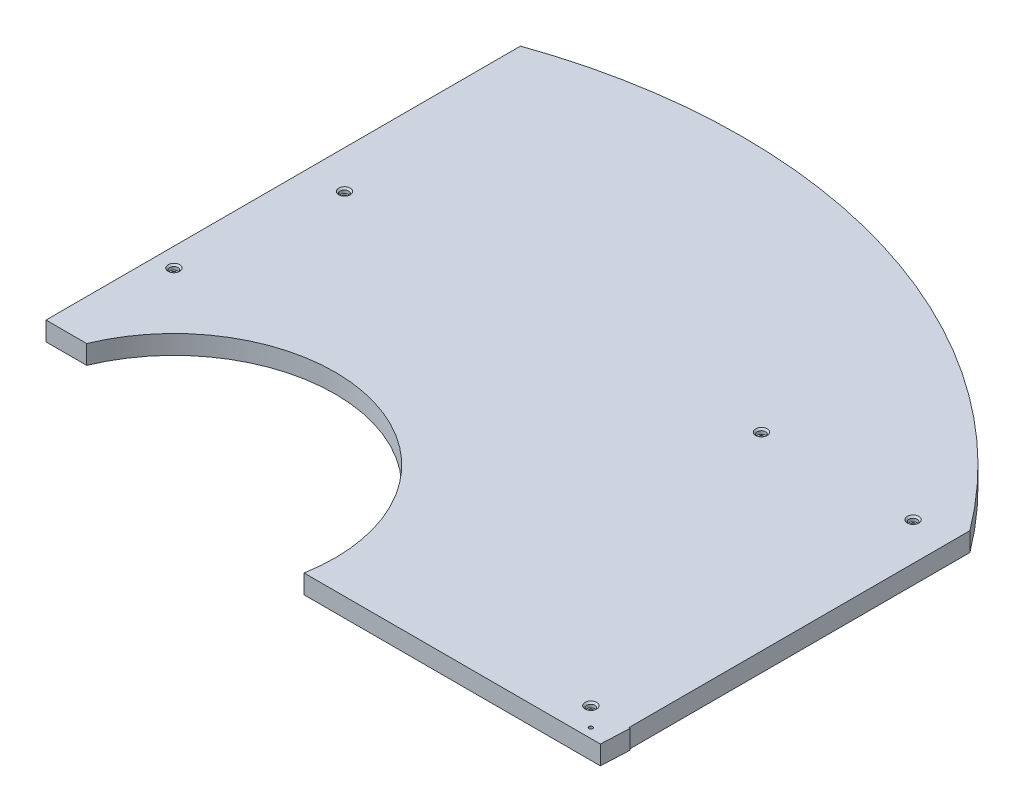
ISO-10303-21;
HEADER;
FILE_DESCRIPTION(('STEP AP214'),'2;1');
FILE_NAME('part.step','',(''),(''),'','','');
FILE_SCHEMA(('AUTOMOTIVE_DESIGN { 1 0 10303 214 1 1 1 1 }'));
ENDSEC;
DATA;
#1=APPLICATION_CONTEXT('core data for automotive mechanical design processes');
#2=APPLICATION_PROTOCOL_DEFINITION('international standard','automotive_design',2000,#1);
#3=PRODUCT_CONTEXT('',#1,'mechanical');
#4=PRODUCT('Part','Part','',(#3));
#5=PRODUCT_RELATED_PRODUCT_CATEGORY('part','',(#4));
#6=PRODUCT_DEFINITION_FORMATION('','',#4);
#7=PRODUCT_DEFINITION_CONTEXT('part definition',#1,'design');
#8=PRODUCT_DEFINITION('design','',#6,#7);
#9=PRODUCT_DEFINITION_SHAPE('','',#8);
#10=(LENGTH_UNIT() NAMED_UNIT(*) SI_UNIT(.MILLI.,.METRE.));
#11=(NAMED_UNIT(*) PLANE_ANGLE_UNIT() SI_UNIT($,.RADIAN.));
#12=(NAMED_UNIT(*) SI_UNIT($,.STERADIAN.) SOLID_ANGLE_UNIT());
#13=UNCERTAINTY_MEASURE_WITH_UNIT(LENGTH_MEASURE(1.E-05),#10,'distance_accuracy_value','');
#14=(GEOMETRIC_REPRESENTATION_CONTEXT(3) GLOBAL_UNCERTAINTY_ASSIGNED_CONTEXT((#13)) GLOBAL_UNIT_ASSIGNED_CONTEXT((#10,
#11,#12)) REPRESENTATION_CONTEXT('',''));
#15=CARTESIAN_POINT('',(0.,0.,0.));
#16=DIRECTION('',(0.,0.,1.));
#17=DIRECTION('',(1.,0.,0.));
#18=AXIS2_PLACEMENT_3D('',#15,#16,#17);
#19=CARTESIAN_POINT('',(0.,25.4,0.));
#20=DIRECTION('',(0.,1.,0.));
#21=DIRECTION('',(0.,0.,1.));
#22=AXIS2_PLACEMENT_3D('',#19,#20,#21);
#23=PLANE('',#22);
#24=CARTESIAN_POINT('',(-76.3797514209196,25.4,8.94521739130427));
#25=DIRECTION('',(0.,1.,0.));
#26=DIRECTION('',(0.,0.,1.));
#27=AXIS2_PLACEMENT_3D('',#24,#25,#26);
#28=CIRCLE('',#27,7.77875);
#29=CARTESIAN_POINT('',(-76.3797514209196,25.4,16.7239673913043));
#30=VERTEX_POINT('',#29);
#31=EDGE_CURVE('E192',#30,#30,#28,.T.);
#32=ORIENTED_EDGE('',*,*,#31,.F.);
#33=EDGE_LOOP('',(#32));
#34=FACE_BOUND('',#33,.T.);
#35=CARTESIAN_POINT('',(-50.9797514209196,25.4,-194.254782608696));
#36=DIRECTION('',(0.,1.,0.));
#37=DIRECTION('',(0.,0.,1.));
#38=AXIS2_PLACEMENT_3D('',#35,#36,#37);
#39=CIRCLE('',#38,7.77875);
#40=CARTESIAN_POINT('',(-50.9797514209196,25.4,-186.476032608696));
#41=VERTEX_POINT('',#40);
#42=EDGE_CURVE('E180',#41,#41,#39,.T.);
#43=ORIENTED_EDGE('',*,*,#42,.F.);
#44=EDGE_LOOP('',(#43));
#45=FACE_BOUND('',#44,.T.);
#46=CARTESIAN_POINT('',(507.82024857908,25.4,-194.254782608696));
#47=DIRECTION('',(0.,1.,0.));
#48=DIRECTION('',(0.,0.,1.));
#49=AXIS2_PLACEMENT_3D('',#46,#47,#48);
#50=CIRCLE('',#49,7.77874999999995);
#51=CARTESIAN_POINT('',(507.82024857908,25.4,-186.476032608696));
#52=VERTEX_POINT('',#51);
#53=EDGE_CURVE('E167',#52,#52,#50,.T.);
#54=ORIENTED_EDGE('',*,*,#53,.F.);
#55=EDGE_LOOP('',(#54));
#56=FACE_BOUND('',#55,.T.);
#57=CARTESIAN_POINT('',(711.020248579081,25.4,237.545217391304));
#58=DIRECTION('',(0.,1.,0.));
#59=DIRECTION('',(0.,0.,1.));
#60=AXIS2_PLACEMENT_3D('',#57,#58,#59);
#61=CIRCLE('',#60,7.77874999999995);
#62=CARTESIAN_POINT('',(711.020248579081,25.4,245.323967391304));
#63=VERTEX_POINT('',#62);
#64=EDGE_CURVE('E154',#63,#63,#61,.T.);
#65=ORIENTED_EDGE('',*,*,#64,.F.);
#66=EDGE_LOOP('',(#65));
#67=FACE_BOUND('',#66,.T.);
#68=CARTESIAN_POINT('',(711.020248579081,25.4,-194.254782608696));
#69=DIRECTION('',(0.,1.,0.));
#70=DIRECTION('',(0.,0.,1.));
#71=AXIS2_PLACEMENT_3D('',#68,#69,#70);
#72=CIRCLE('',#71,7.77874999999995);
#73=CARTESIAN_POINT('',(711.020248579081,25.4,-186.476032608696));
#74=VERTEX_POINT('',#73);
#75=EDGE_CURVE('E141',#74,#74,#72,.T.);
#76=ORIENTED_EDGE('',*,*,#75,.F.);
#77=EDGE_LOOP('',(#76));
#78=FACE_BOUND('',#77,.T.);
#79=DIRECTION('',(0.,0.,1.));
#80=VECTOR('',#79,1.);
#81=CARTESIAN_POINT('',(761.820248579081,25.4,237.545217391304));
#82=LINE('',#81,#80);
#83=CARTESIAN_POINT('',(761.820248579081,25.4,-219.654782608696));
#84=VERTEX_POINT('',#83);
#85=CARTESIAN_POINT('',(761.820248579081,25.4,237.545217391304));
#86=VERTEX_POINT('',#85);
#87=EDGE_CURVE('E113',#84,#86,#82,.T.);
#88=ORIENTED_EDGE('',*,*,#87,.F.);
#89=CARTESIAN_POINT('',(152.22024857908,25.4,237.545217391304));
#90=DIRECTION('',(0.,-1.,0.));
#91=DIRECTION('',(0.,0.,1.));
#92=AXIS2_PLACEMENT_3D('',#89,#90,#91);
#93=CIRCLE('',#92,762.);
#94=CARTESIAN_POINT('',(-101.77975142092,25.4,-480.875272294228));
#95=VERTEX_POINT('',#94);
#96=EDGE_CURVE('E326',#95,#84,#93,.T.);
#97=ORIENTED_EDGE('',*,*,#96,.F.);
#98=DIRECTION('',(0.,0.,-1.));
#99=VECTOR('',#98,1.);
#100=CARTESIAN_POINT('',(-101.77975142092,25.4,-524.454782608696));
#101=LINE('',#100,#99);
#102=CARTESIAN_POINT('',(-101.77975142092,25.4,154.995217391304));
#103=VERTEX_POINT('',#102);
#104=EDGE_CURVE('E275',#103,#95,#101,.T.);
#105=ORIENTED_EDGE('',*,*,#104,.F.);
#106=DIRECTION('',(-1.,0.,0.));
#107=VECTOR('',#106,1.);
#108=CARTESIAN_POINT('',(-406.57975142092,25.4,154.995217391304));
#109=LINE('',#108,#107);
#110=CARTESIAN_POINT('',(-47.2748829404631,25.4,154.995217391304));
#111=VERTEX_POINT('',#110);
#112=EDGE_CURVE('E58',#111,#103,#109,.T.);
#113=ORIENTED_EDGE('',*,*,#112,.F.);
#114=CARTESIAN_POINT('',(152.22024857908,25.4,237.545217391304));
#115=DIRECTION('',(0.,-1.,0.));
#116=DIRECTION('',(0.,0.,1.));
#117=AXIS2_PLACEMENT_3D('',#114,#115,#116);
#118=CIRCLE('',#117,215.9);
#119=CARTESIAN_POINT('',(364.731895318736,25.4,275.645217391304));
#120=VERTEX_POINT('',#119);
#121=EDGE_CURVE('E274',#111,#120,#118,.T.);
#122=ORIENTED_EDGE('',*,*,#121,.T.);
#123=DIRECTION('',(1.,0.,0.));
#124=VECTOR('',#123,1.);
#125=CARTESIAN_POINT('',(761.820248579081,25.4,275.645217391304));
#126=LINE('',#125,#124);
#127=CARTESIAN_POINT('',(761.820248579081,25.4,275.645217391304));
#128=VERTEX_POINT('',#127);
#129=EDGE_CURVE('E289',#120,#128,#126,.T.);
#130=ORIENTED_EDGE('',*,*,#129,.T.);
#131=DIRECTION('',(0.0453748812305495,0.,-0.998970029657203));
#132=VECTOR('',#131,1.);
#133=CARTESIAN_POINT('',(763.550813985009,25.4,237.545217391304));
#134=LINE('',#133,#132);
#135=CARTESIAN_POINT('',(763.550815120551,25.4,237.545217391304));
#136=VERTEX_POINT('',#135);
#137=EDGE_CURVE('E125',#128,#136,#134,.T.);
#138=ORIENTED_EDGE('',*,*,#137,.T.);
#139=DIRECTION('',(1.,0.,0.));
#140=VECTOR('',#139,1.);
#141=CARTESIAN_POINT('',(1600.02024857908,25.4,237.545217391304));
#142=LINE('',#141,#140);
#143=EDGE_CURVE('E104',#86,#136,#142,.T.);
#144=ORIENTED_EDGE('',*,*,#143,.F.);
#145=EDGE_LOOP('',(#88,#97,#105,#113,#122,#130,#138,#144));
#146=FACE_BOUND('',#145,.T.);
#147=CARTESIAN_POINT('',(736.420248579081,25.4,262.945217391304));
#148=DIRECTION('',(0.,1.,0.));
#149=DIRECTION('',(0.,0.,1.));
#150=AXIS2_PLACEMENT_3D('',#147,#148,#149);
#151=CIRCLE('',#150,2.55269999999996);
#152=CARTESIAN_POINT('',(736.420248579081,25.4,265.497917391304));
#153=VERTEX_POINT('',#152);
#154=EDGE_CURVE('E314',#153,#153,#151,.T.);
#155=ORIENTED_EDGE('',*,*,#154,.F.);
#156=EDGE_LOOP('',(#155));
#157=FACE_BOUND('',#156,.T.);
#158=ADVANCED_FACE('F34',(#34,#45,#56,#67,#78,#146,#157),#23,.T.);
#159=CARTESIAN_POINT('',(0.,0.,0.));
#160=DIRECTION('',(0.,1.,0.));
#161=DIRECTION('',(0.,0.,1.));
#162=AXIS2_PLACEMENT_3D('',#159,#160,#161);
#163=PLANE('',#162);
#164=CARTESIAN_POINT('',(-76.3797514209196,0.,8.94521739130427));
#165=DIRECTION('',(0.,1.,0.));
#166=DIRECTION('',(0.,0.,1.));
#167=AXIS2_PLACEMENT_3D('',#164,#165,#166);
#168=CIRCLE('',#167,3.3782);
#169=CARTESIAN_POINT('',(-76.3797514209196,0.,12.3234173913043));
#170=VERTEX_POINT('',#169);
#171=EDGE_CURVE('E38',#170,#170,#168,.T.);
#172=ORIENTED_EDGE('',*,*,#171,.T.);
#173=EDGE_LOOP('',(#172));
#174=FACE_BOUND('',#173,.T.);
#175=CARTESIAN_POINT('',(-50.9797514209196,0.,-194.254782608696));
#176=DIRECTION('',(0.,1.,0.));
#177=DIRECTION('',(0.,0.,1.));
#178=AXIS2_PLACEMENT_3D('',#175,#176,#177);
#179=CIRCLE('',#178,3.37819999999999);
#180=CARTESIAN_POINT('',(-50.9797514209196,0.,-190.876582608696));
#181=VERTEX_POINT('',#180);
#182=EDGE_CURVE('E170',#181,#181,#179,.T.);
#183=ORIENTED_EDGE('',*,*,#182,.T.);
#184=EDGE_LOOP('',(#183));
#185=FACE_BOUND('',#184,.T.);
#186=CARTESIAN_POINT('',(507.82024857908,0.,-194.254782608696));
#187=DIRECTION('',(0.,1.,0.));
#188=DIRECTION('',(0.,0.,1.));
#189=AXIS2_PLACEMENT_3D('',#186,#187,#188);
#190=CIRCLE('',#189,3.3782);
#191=CARTESIAN_POINT('',(507.82024857908,0.,-190.876582608696));
#192=VERTEX_POINT('',#191);
#193=EDGE_CURVE('E157',#192,#192,#190,.T.);
#194=ORIENTED_EDGE('',*,*,#193,.T.);
#195=EDGE_LOOP('',(#194));
#196=FACE_BOUND('',#195,.T.);
#197=CARTESIAN_POINT('',(711.020248579081,0.,237.545217391304));
#198=DIRECTION('',(0.,1.,0.));
#199=DIRECTION('',(0.,0.,1.));
#200=AXIS2_PLACEMENT_3D('',#197,#198,#199);
#201=CIRCLE('',#200,3.3782);
#202=CARTESIAN_POINT('',(711.020248579081,0.,240.923417391304));
#203=VERTEX_POINT('',#202);
#204=EDGE_CURVE('E144',#203,#203,#201,.T.);
#205=ORIENTED_EDGE('',*,*,#204,.T.);
#206=EDGE_LOOP('',(#205));
#207=FACE_BOUND('',#206,.T.);
#208=CARTESIAN_POINT('',(711.020248579081,0.,-194.254782608696));
#209=DIRECTION('',(0.,1.,0.));
#210=DIRECTION('',(0.,0.,1.));
#211=AXIS2_PLACEMENT_3D('',#208,#209,#210);
#212=CIRCLE('',#211,3.3782);
#213=CARTESIAN_POINT('',(711.020248579081,0.,-190.876582608696));
#214=VERTEX_POINT('',#213);
#215=EDGE_CURVE('E119',#214,#214,#212,.T.);
#216=ORIENTED_EDGE('',*,*,#215,.T.);
#217=EDGE_LOOP('',(#216));
#218=FACE_BOUND('',#217,.T.);
#219=CARTESIAN_POINT('',(736.420248579081,0.,262.945217391304));
#220=DIRECTION('',(0.,1.,0.));
#221=DIRECTION('',(0.,0.,1.));
#222=AXIS2_PLACEMENT_3D('',#219,#220,#221);
#223=CIRCLE('',#222,2.55269999999996);
#224=CARTESIAN_POINT('',(736.420248579081,0.,265.497917391304));
#225=VERTEX_POINT('',#224);
#226=EDGE_CURVE('E312',#225,#225,#223,.T.);
#227=ORIENTED_EDGE('',*,*,#226,.T.);
#228=EDGE_LOOP('',(#227));
#229=FACE_BOUND('',#228,.T.);
#230=CARTESIAN_POINT('',(152.22024857908,0.,237.545217391304));
#231=DIRECTION('',(0.,1.,0.));
#232=DIRECTION('',(0.,0.,1.));
#233=AXIS2_PLACEMENT_3D('',#230,#231,#232);
#234=CIRCLE('',#233,762.);
#235=CARTESIAN_POINT('',(-101.77975142092,0.,-480.875272294228));
#236=VERTEX_POINT('',#235);
#237=CARTESIAN_POINT('',(761.820248579081,0.,-219.654782608696));
#238=VERTEX_POINT('',#237);
#239=EDGE_CURVE('E51',#236,#238,#234,.F.);
#240=ORIENTED_EDGE('',*,*,#239,.T.);
#241=DIRECTION('',(0.,0.,1.));
#242=VECTOR('',#241,1.);
#243=CARTESIAN_POINT('',(761.820248579081,0.,0.));
#244=LINE('',#243,#242);
#245=CARTESIAN_POINT('',(761.820248579081,0.,237.545217391304));
#246=VERTEX_POINT('',#245);
#247=EDGE_CURVE('E110',#238,#246,#244,.T.);
#248=ORIENTED_EDGE('',*,*,#247,.T.);
#249=DIRECTION('',(1.,0.,0.));
#250=VECTOR('',#249,1.);
#251=CARTESIAN_POINT('',(0.,0.,237.545217391304));
#252=LINE('',#251,#250);
#253=CARTESIAN_POINT('',(763.550813985009,0.,237.545217391304));
#254=VERTEX_POINT('',#253);
#255=EDGE_CURVE('E107',#246,#254,#252,.T.);
#256=ORIENTED_EDGE('',*,*,#255,.T.);
#257=DIRECTION('',(0.0453748812305495,0.,-0.998970029657203));
#258=VECTOR('',#257,1.);
#259=CARTESIAN_POINT('',(763.550813985009,0.,237.545217391304));
#260=LINE('',#259,#258);
#261=CARTESIAN_POINT('',(761.820248579081,0.,275.645217391304));
#262=VERTEX_POINT('',#261);
#263=EDGE_CURVE('E287',#262,#254,#260,.T.);
#264=ORIENTED_EDGE('',*,*,#263,.F.);
#265=DIRECTION('',(1.,0.,0.));
#266=VECTOR('',#265,1.);
#267=CARTESIAN_POINT('',(761.820248579081,0.,275.645217391304));
#268=LINE('',#267,#266);
#269=CARTESIAN_POINT('',(364.731895318736,0.,275.645217391304));
#270=VERTEX_POINT('',#269);
#271=EDGE_CURVE('E285',#270,#262,#268,.T.);
#272=ORIENTED_EDGE('',*,*,#271,.F.);
#273=CARTESIAN_POINT('',(152.22024857908,0.,237.545217391304));
#274=DIRECTION('',(0.,-1.,0.));
#275=DIRECTION('',(0.,0.,1.));
#276=AXIS2_PLACEMENT_3D('',#273,#274,#275);
#277=CIRCLE('',#276,215.9);
#278=CARTESIAN_POINT('',(-47.2748829404631,0.,154.995217391304));
#279=VERTEX_POINT('',#278);
#280=EDGE_CURVE('E272',#279,#270,#277,.T.);
#281=ORIENTED_EDGE('',*,*,#280,.F.);
#282=DIRECTION('',(-1.,0.,0.));
#283=VECTOR('',#282,1.);
#284=CARTESIAN_POINT('',(0.,0.,154.995217391304));
#285=LINE('',#284,#283);
#286=CARTESIAN_POINT('',(-101.77975142092,0.,154.995217391304));
#287=VERTEX_POINT('',#286);
#288=EDGE_CURVE('E276',#279,#287,#285,.T.);
#289=ORIENTED_EDGE('',*,*,#288,.T.);
#290=DIRECTION('',(0.,0.,-1.));
#291=VECTOR('',#290,1.);
#292=CARTESIAN_POINT('',(-101.77975142092,0.,0.));
#293=LINE('',#292,#291);
#294=EDGE_CURVE('E303',#287,#236,#293,.T.);
#295=ORIENTED_EDGE('',*,*,#294,.T.);
#296=EDGE_LOOP('',(#240,#248,#256,#264,#272,#281,#289,#295));
#297=FACE_BOUND('',#296,.T.);
#298=ADVANCED_FACE('F36',(#174,#185,#196,#207,#218,#229,#297),#163,.F.);
#299=CARTESIAN_POINT('',(152.22024857908,0.,237.545217391304));
#300=DIRECTION('',(0.,1.,0.));
#301=DIRECTION('',(0.,0.,1.));
#302=AXIS2_PLACEMENT_3D('',#299,#300,#301);
#303=CYLINDRICAL_SURFACE('',#302,215.9);
#304=DIRECTION('',(0.,1.,0.));
#305=VECTOR('',#304,1.);
#306=CARTESIAN_POINT('',(-47.2748829404631,0.,154.995217391304));
#307=LINE('',#306,#305);
#308=EDGE_CURVE('E269',#279,#111,#307,.T.);
#309=ORIENTED_EDGE('',*,*,#308,.F.);
#310=ORIENTED_EDGE('',*,*,#280,.T.);
#311=DIRECTION('',(0.,1.,0.));
#312=VECTOR('',#311,1.);
#313=CARTESIAN_POINT('',(364.731895318736,0.,275.645217391304));
#314=LINE('',#313,#312);
#315=EDGE_CURVE('E309',#270,#120,#314,.T.);
#316=ORIENTED_EDGE('',*,*,#315,.T.);
#317=ORIENTED_EDGE('',*,*,#121,.F.);
#318=EDGE_LOOP('',(#309,#310,#316,#317));
#319=FACE_BOUND('',#318,.T.);
#320=ADVANCED_FACE('F256',(#319),#303,.F.);
#321=CARTESIAN_POINT('',(763.550813985009,0.,237.545217391304));
#322=DIRECTION('',(0.998970029657203,0.,0.0453748812305495));
#323=DIRECTION('',(0.0453748812305495,0.,-0.998970029657203));
#324=AXIS2_PLACEMENT_3D('',#321,#322,#323);
#325=PLANE('',#324);
#326=ORIENTED_EDGE('',*,*,#137,.F.);
#327=DIRECTION('',(0.,1.,0.));
#328=VECTOR('',#327,1.);
#329=CARTESIAN_POINT('',(761.820248579081,0.,275.645217391304));
#330=LINE('',#329,#328);
#331=EDGE_CURVE('E304',#262,#128,#330,.T.);
#332=ORIENTED_EDGE('',*,*,#331,.F.);
#333=ORIENTED_EDGE('',*,*,#263,.T.);
#334=DIRECTION('',(0.,1.,0.));
#335=VECTOR('',#334,1.);
#336=CARTESIAN_POINT('',(763.550813985009,0.,237.545217391304));
#337=LINE('',#336,#335);
#338=EDGE_CURVE('E300',#254,#136,#337,.T.);
#339=ORIENTED_EDGE('',*,*,#338,.T.);
#340=EDGE_LOOP('',(#326,#332,#333,#339));
#341=FACE_BOUND('',#340,.T.);
#342=ADVANCED_FACE('F253',(#341),#325,.T.);
#343=CARTESIAN_POINT('',(761.820248579081,0.,275.645217391304));
#344=DIRECTION('',(0.,0.,1.));
#345=DIRECTION('',(1.,0.,0.));
#346=AXIS2_PLACEMENT_3D('',#343,#344,#345);
#347=PLANE('',#346);
#348=ORIENTED_EDGE('',*,*,#129,.F.);
#349=ORIENTED_EDGE('',*,*,#315,.F.);
#350=ORIENTED_EDGE('',*,*,#271,.T.);
#351=ORIENTED_EDGE('',*,*,#331,.T.);
#352=EDGE_LOOP('',(#348,#349,#350,#351));
#353=FACE_BOUND('',#352,.T.);
#354=ADVANCED_FACE('F251',(#353),#347,.T.);
#355=CARTESIAN_POINT('',(736.420248579081,25.4,262.945217391304));
#356=DIRECTION('',(0.,1.,0.));
#357=DIRECTION('',(0.,0.,1.));
#358=AXIS2_PLACEMENT_3D('',#355,#356,#357);
#359=CYLINDRICAL_SURFACE('',#358,2.55269999999996);
#360=ORIENTED_EDGE('',*,*,#154,.T.);
#361=EDGE_LOOP('',(#360));
#362=FACE_BOUND('',#361,.T.);
#363=ORIENTED_EDGE('',*,*,#226,.F.);
#364=EDGE_LOOP('',(#363));
#365=FACE_BOUND('',#364,.T.);
#366=ADVANCED_FACE('F247',(#362,#365),#359,.F.);
#367=CARTESIAN_POINT('',(-101.77975142092,-5.00000000014378E-05,-524.454782608696));
#368=DIRECTION('',(1.,0.,0.));
#369=DIRECTION('',(0.,0.,-1.));
#370=AXIS2_PLACEMENT_3D('',#367,#368,#369);
#371=PLANE('',#370);
#372=ORIENTED_EDGE('',*,*,#104,.T.);
#373=DIRECTION('',(0.,1.,0.));
#374=VECTOR('',#373,1.);
#375=CARTESIAN_POINT('',(-101.77975142092,-5.00000000014378E-05,-480.875272294228));
#376=LINE('',#375,#374);
#377=EDGE_CURVE('E11',#95,#236,#376,.F.);
#378=ORIENTED_EDGE('',*,*,#377,.T.);
#379=ORIENTED_EDGE('',*,*,#294,.F.);
#380=DIRECTION('',(0.,1.,0.));
#381=VECTOR('',#380,1.);
#382=CARTESIAN_POINT('',(-101.77975142092,-5.00000000014378E-05,154.995217391304));
#383=LINE('',#382,#381);
#384=EDGE_CURVE('E43',#287,#103,#383,.T.);
#385=ORIENTED_EDGE('',*,*,#384,.T.);
#386=EDGE_LOOP('',(#372,#378,#379,#385));
#387=FACE_BOUND('',#386,.T.);
#388=ADVANCED_FACE('F244',(#387),#371,.F.);
#389=CARTESIAN_POINT('',(-406.57975142092,-5.00000000014378E-05,154.995217391304));
#390=DIRECTION('',(0.,0.,-1.));
#391=DIRECTION('',(-1.,0.,0.));
#392=AXIS2_PLACEMENT_3D('',#389,#390,#391);
#393=PLANE('',#392);
#394=ORIENTED_EDGE('',*,*,#308,.T.);
#395=ORIENTED_EDGE('',*,*,#112,.T.);
#396=ORIENTED_EDGE('',*,*,#384,.F.);
#397=ORIENTED_EDGE('',*,*,#288,.F.);
#398=EDGE_LOOP('',(#394,#395,#396,#397));
#399=FACE_BOUND('',#398,.T.);
#400=ADVANCED_FACE('F241',(#399),#393,.F.);
#401=CARTESIAN_POINT('',(152.22024857908,-5.00000000014378E-05,237.545217391304));
#402=DIRECTION('',(0.,1.,0.));
#403=DIRECTION('',(0.,0.,1.));
#404=AXIS2_PLACEMENT_3D('',#401,#402,#403);
#405=CYLINDRICAL_SURFACE('',#404,762.);
#406=ORIENTED_EDGE('',*,*,#377,.F.);
#407=ORIENTED_EDGE('',*,*,#96,.T.);
#408=DIRECTION('',(0.,1.,0.));
#409=VECTOR('',#408,1.);
#410=CARTESIAN_POINT('',(761.820248579081,-5.00000000014378E-05,-219.654782608696));
#411=LINE('',#410,#409);
#412=EDGE_CURVE('E115',#238,#84,#411,.T.);
#413=ORIENTED_EDGE('',*,*,#412,.F.);
#414=ORIENTED_EDGE('',*,*,#239,.F.);
#415=EDGE_LOOP('',(#406,#407,#413,#414));
#416=FACE_BOUND('',#415,.T.);
#417=ADVANCED_FACE('F236',(#416),#405,.T.);
#418=CARTESIAN_POINT('',(1600.02024857908,-5.00000000014378E-05,237.545217391304));
#419=DIRECTION('',(0.,0.,1.));
#420=DIRECTION('',(1.,0.,0.));
#421=AXIS2_PLACEMENT_3D('',#418,#419,#420);
#422=PLANE('',#421);
#423=DIRECTION('',(0.,1.,0.));
#424=VECTOR('',#423,1.);
#425=CARTESIAN_POINT('',(761.820248579081,-5.00000000014378E-05,237.545217391304));
#426=LINE('',#425,#424);
#427=EDGE_CURVE('E100',#246,#86,#426,.T.);
#428=ORIENTED_EDGE('',*,*,#427,.T.);
#429=ORIENTED_EDGE('',*,*,#143,.T.);
#430=ORIENTED_EDGE('',*,*,#338,.F.);
#431=ORIENTED_EDGE('',*,*,#255,.F.);
#432=EDGE_LOOP('',(#428,#429,#430,#431));
#433=FACE_BOUND('',#432,.T.);
#434=ADVANCED_FACE('F102',(#433),#422,.F.);
#435=CARTESIAN_POINT('',(761.820248579081,-5.00000000014378E-05,237.545217391304));
#436=DIRECTION('',(-1.,0.,0.));
#437=DIRECTION('',(0.,0.,1.));
#438=AXIS2_PLACEMENT_3D('',#435,#436,#437);
#439=PLANE('',#438);
#440=ORIENTED_EDGE('',*,*,#412,.T.);
#441=ORIENTED_EDGE('',*,*,#87,.T.);
#442=ORIENTED_EDGE('',*,*,#427,.F.);
#443=ORIENTED_EDGE('',*,*,#247,.F.);
#444=EDGE_LOOP('',(#440,#441,#442,#443));
#445=FACE_BOUND('',#444,.T.);
#446=ADVANCED_FACE('F114',(#445),#439,.F.);
#447=CARTESIAN_POINT('',(711.020248579081,25.4,-194.254782608696));
#448=DIRECTION('',(0.,1.,0.));
#449=DIRECTION('',(0.,0.,1.));
#450=AXIS2_PLACEMENT_3D('',#447,#448,#449);
#451=CYLINDRICAL_SURFACE('',#450,3.3782);
#452=CARTESIAN_POINT('',(711.020248579081,19.05,-194.254782608696));
#453=DIRECTION('',(0.,1.,0.));
#454=DIRECTION('',(0.,0.,1.));
#455=AXIS2_PLACEMENT_3D('',#452,#453,#454);
#456=CIRCLE('',#455,3.3782);
#457=CARTESIAN_POINT('',(711.020248579081,19.05,-190.876582608696));
#458=VERTEX_POINT('',#457);
#459=EDGE_CURVE('E132',#458,#458,#456,.T.);
#460=ORIENTED_EDGE('',*,*,#459,.T.);
#461=EDGE_LOOP('',(#460));
#462=FACE_BOUND('',#461,.T.);
#463=ORIENTED_EDGE('',*,*,#215,.F.);
#464=EDGE_LOOP('',(#463));
#465=FACE_BOUND('',#464,.T.);
#466=ADVANCED_FACE('F229',(#462,#465),#451,.F.);
#467=CARTESIAN_POINT('',(716.576498579081,19.05,-194.254782608696));
#468=DIRECTION('',(0.,-1.,0.));
#469=DIRECTION('',(0.,0.,-1.));
#470=AXIS2_PLACEMENT_3D('',#467,#468,#469);
#471=PLANE('',#470);
#472=ORIENTED_EDGE('',*,*,#459,.F.);
#473=EDGE_LOOP('',(#472));
#474=FACE_BOUND('',#473,.T.);
#475=CARTESIAN_POINT('',(711.020248579081,19.05,-194.254782608696));
#476=DIRECTION('',(0.,1.,0.));
#477=DIRECTION('',(0.,0.,1.));
#478=AXIS2_PLACEMENT_3D('',#475,#476,#477);
#479=CIRCLE('',#478,5.55625000000004);
#480=CARTESIAN_POINT('',(711.020248579081,19.05,-188.698532608696));
#481=VERTEX_POINT('',#480);
#482=EDGE_CURVE('E135',#481,#481,#479,.T.);
#483=ORIENTED_EDGE('',*,*,#482,.T.);
#484=EDGE_LOOP('',(#483));
#485=FACE_BOUND('',#484,.T.);
#486=ADVANCED_FACE('F221',(#474,#485),#471,.F.);
#487=CARTESIAN_POINT('',(711.020248579081,25.4,-194.254782608696));
#488=DIRECTION('',(0.,1.,0.));
#489=DIRECTION('',(0.,0.,1.));
#490=AXIS2_PLACEMENT_3D('',#487,#488,#489);
#491=CYLINDRICAL_SURFACE('',#490,5.55625000000004);
#492=ORIENTED_EDGE('',*,*,#482,.F.);
#493=EDGE_LOOP('',(#492));
#494=FACE_BOUND('',#493,.T.);
#495=CARTESIAN_POINT('',(711.020248579081,23.1775,-194.254782608696));
#496=DIRECTION('',(0.,1.,0.));
#497=DIRECTION('',(0.,0.,1.));
#498=AXIS2_PLACEMENT_3D('',#495,#496,#497);
#499=CIRCLE('',#498,5.55625000000004);
#500=CARTESIAN_POINT('',(711.020248579081,23.1775,-188.698532608696));
#501=VERTEX_POINT('',#500);
#502=EDGE_CURVE('E138',#501,#501,#499,.T.);
#503=ORIENTED_EDGE('',*,*,#502,.T.);
#504=EDGE_LOOP('',(#503));
#505=FACE_BOUND('',#504,.T.);
#506=ADVANCED_FACE('F211',(#494,#505),#491,.F.);
#507=CARTESIAN_POINT('',(711.020248579081,25.4,-194.254782608696));
#508=DIRECTION('',(0.,1.,0.));
#509=DIRECTION('',(0.,0.,1.));
#510=AXIS2_PLACEMENT_3D('',#507,#508,#509);
#511=CONICAL_SURFACE('',#510,7.77874999999995,0.785398163397426);
#512=ORIENTED_EDGE('',*,*,#502,.F.);
#513=EDGE_LOOP('',(#512));
#514=FACE_BOUND('',#513,.T.);
#515=ORIENTED_EDGE('',*,*,#75,.T.);
#516=EDGE_LOOP('',(#515));
#517=FACE_BOUND('',#516,.T.);
#518=ADVANCED_FACE('F208',(#514,#517),#511,.F.);
#519=CARTESIAN_POINT('',(711.020248579081,25.4,237.545217391304));
#520=DIRECTION('',(0.,1.,0.));
#521=DIRECTION('',(0.,0.,1.));
#522=AXIS2_PLACEMENT_3D('',#519,#520,#521);
#523=CYLINDRICAL_SURFACE('',#522,3.3782);
#524=CARTESIAN_POINT('',(711.020248579081,19.05,237.545217391304));
#525=DIRECTION('',(0.,1.,0.));
#526=DIRECTION('',(0.,0.,1.));
#527=AXIS2_PLACEMENT_3D('',#524,#525,#526);
#528=CIRCLE('',#527,3.3782);
#529=CARTESIAN_POINT('',(711.020248579081,19.05,240.923417391304));
#530=VERTEX_POINT('',#529);
#531=EDGE_CURVE('E145',#530,#530,#528,.T.);
#532=ORIENTED_EDGE('',*,*,#531,.T.);
#533=EDGE_LOOP('',(#532));
#534=FACE_BOUND('',#533,.T.);
#535=ORIENTED_EDGE('',*,*,#204,.F.);
#536=EDGE_LOOP('',(#535));
#537=FACE_BOUND('',#536,.T.);
#538=ADVANCED_FACE('F210',(#534,#537),#523,.F.);
#539=CARTESIAN_POINT('',(716.576498579081,19.05,237.545217391304));
#540=DIRECTION('',(0.,-1.,0.));
#541=DIRECTION('',(0.,0.,-1.));
#542=AXIS2_PLACEMENT_3D('',#539,#540,#541);
#543=PLANE('',#542);
#544=ORIENTED_EDGE('',*,*,#531,.F.);
#545=EDGE_LOOP('',(#544));
#546=FACE_BOUND('',#545,.T.);
#547=CARTESIAN_POINT('',(711.020248579081,19.05,237.545217391304));
#548=DIRECTION('',(0.,1.,0.));
#549=DIRECTION('',(0.,0.,1.));
#550=AXIS2_PLACEMENT_3D('',#547,#548,#549);
#551=CIRCLE('',#550,5.55625000000004);
#552=CARTESIAN_POINT('',(711.020248579081,19.05,243.101467391304));
#553=VERTEX_POINT('',#552);
#554=EDGE_CURVE('E148',#553,#553,#551,.T.);
#555=ORIENTED_EDGE('',*,*,#554,.T.);
#556=EDGE_LOOP('',(#555));
#557=FACE_BOUND('',#556,.T.);
#558=ADVANCED_FACE('F218',(#546,#557),#543,.F.);
#559=CARTESIAN_POINT('',(711.020248579081,25.4,237.545217391304));
#560=DIRECTION('',(0.,1.,0.));
#561=DIRECTION('',(0.,0.,1.));
#562=AXIS2_PLACEMENT_3D('',#559,#560,#561);
#563=CYLINDRICAL_SURFACE('',#562,5.55625000000004);
#564=ORIENTED_EDGE('',*,*,#554,.F.);
#565=EDGE_LOOP('',(#564));
#566=FACE_BOUND('',#565,.T.);
#567=CARTESIAN_POINT('',(711.020248579081,23.1775,237.545217391304));
#568=DIRECTION('',(0.,1.,0.));
#569=DIRECTION('',(0.,0.,1.));
#570=AXIS2_PLACEMENT_3D('',#567,#568,#569);
#571=CIRCLE('',#570,5.55625000000004);
#572=CARTESIAN_POINT('',(711.020248579081,23.1775,243.101467391304));
#573=VERTEX_POINT('',#572);
#574=EDGE_CURVE('E151',#573,#573,#571,.T.);
#575=ORIENTED_EDGE('',*,*,#574,.T.);
#576=EDGE_LOOP('',(#575));
#577=FACE_BOUND('',#576,.T.);
#578=ADVANCED_FACE('F379',(#566,#577),#563,.F.);
#579=CARTESIAN_POINT('',(711.020248579081,25.4,237.545217391304));
#580=DIRECTION('',(0.,1.,0.));
#581=DIRECTION('',(0.,0.,1.));
#582=AXIS2_PLACEMENT_3D('',#579,#580,#581);
#583=CONICAL_SURFACE('',#582,7.77874999999995,0.785398163397426);
#584=ORIENTED_EDGE('',*,*,#574,.F.);
#585=EDGE_LOOP('',(#584));
#586=FACE_BOUND('',#585,.T.);
#587=ORIENTED_EDGE('',*,*,#64,.T.);
#588=EDGE_LOOP('',(#587));
#589=FACE_BOUND('',#588,.T.);
#590=ADVANCED_FACE('F375',(#586,#589),#583,.F.);
#591=CARTESIAN_POINT('',(507.82024857908,25.4,-194.254782608696));
#592=DIRECTION('',(0.,1.,0.));
#593=DIRECTION('',(0.,0.,1.));
#594=AXIS2_PLACEMENT_3D('',#591,#592,#593);
#595=CYLINDRICAL_SURFACE('',#594,3.3782);
#596=CARTESIAN_POINT('',(507.82024857908,19.05,-194.254782608696));
#597=DIRECTION('',(0.,1.,0.));
#598=DIRECTION('',(0.,0.,1.));
#599=AXIS2_PLACEMENT_3D('',#596,#597,#598);
#600=CIRCLE('',#599,3.3782);
#601=CARTESIAN_POINT('',(507.82024857908,19.05,-190.876582608696));
#602=VERTEX_POINT('',#601);
#603=EDGE_CURVE('E158',#602,#602,#600,.T.);
#604=ORIENTED_EDGE('',*,*,#603,.T.);
#605=EDGE_LOOP('',(#604));
#606=FACE_BOUND('',#605,.T.);
#607=ORIENTED_EDGE('',*,*,#193,.F.);
#608=EDGE_LOOP('',(#607));
#609=FACE_BOUND('',#608,.T.);
#610=ADVANCED_FACE('F371',(#606,#609),#595,.F.);
#611=CARTESIAN_POINT('',(513.37649857908,19.05,-194.254782608696));
#612=DIRECTION('',(0.,-1.,0.));
#613=DIRECTION('',(0.,0.,-1.));
#614=AXIS2_PLACEMENT_3D('',#611,#612,#613);
#615=PLANE('',#614);
#616=ORIENTED_EDGE('',*,*,#603,.F.);
#617=EDGE_LOOP('',(#616));
#618=FACE_BOUND('',#617,.T.);
#619=CARTESIAN_POINT('',(507.82024857908,19.05,-194.254782608696));
#620=DIRECTION('',(0.,1.,0.));
#621=DIRECTION('',(0.,0.,1.));
#622=AXIS2_PLACEMENT_3D('',#619,#620,#621);
#623=CIRCLE('',#622,5.55625000000004);
#624=CARTESIAN_POINT('',(507.82024857908,19.05,-188.698532608696));
#625=VERTEX_POINT('',#624);
#626=EDGE_CURVE('E161',#625,#625,#623,.T.);
#627=ORIENTED_EDGE('',*,*,#626,.T.);
#628=EDGE_LOOP('',(#627));
#629=FACE_BOUND('',#628,.T.);
#630=ADVANCED_FACE('F367',(#618,#629),#615,.F.);
#631=CARTESIAN_POINT('',(507.82024857908,25.4,-194.254782608696));
#632=DIRECTION('',(0.,1.,0.));
#633=DIRECTION('',(0.,0.,1.));
#634=AXIS2_PLACEMENT_3D('',#631,#632,#633);
#635=CYLINDRICAL_SURFACE('',#634,5.55625000000004);
#636=ORIENTED_EDGE('',*,*,#626,.F.);
#637=EDGE_LOOP('',(#636));
#638=FACE_BOUND('',#637,.T.);
#639=CARTESIAN_POINT('',(507.82024857908,23.1775,-194.254782608696));
#640=DIRECTION('',(0.,1.,0.));
#641=DIRECTION('',(0.,0.,1.));
#642=AXIS2_PLACEMENT_3D('',#639,#640,#641);
#643=CIRCLE('',#642,5.55625000000004);
#644=CARTESIAN_POINT('',(507.82024857908,23.1775,-188.698532608696));
#645=VERTEX_POINT('',#644);
#646=EDGE_CURVE('E164',#645,#645,#643,.T.);
#647=ORIENTED_EDGE('',*,*,#646,.T.);
#648=EDGE_LOOP('',(#647));
#649=FACE_BOUND('',#648,.T.);
#650=ADVANCED_FACE('F360',(#638,#649),#635,.F.);
#651=CARTESIAN_POINT('',(507.82024857908,25.4,-194.254782608696));
#652=DIRECTION('',(0.,1.,0.));
#653=DIRECTION('',(0.,0.,1.));
#654=AXIS2_PLACEMENT_3D('',#651,#652,#653);
#655=CONICAL_SURFACE('',#654,7.77874999999995,0.785398163397426);
#656=ORIENTED_EDGE('',*,*,#646,.F.);
#657=EDGE_LOOP('',(#656));
#658=FACE_BOUND('',#657,.T.);
#659=ORIENTED_EDGE('',*,*,#53,.T.);
#660=EDGE_LOOP('',(#659));
#661=FACE_BOUND('',#660,.T.);
#662=ADVANCED_FACE('F350',(#658,#661),#655,.F.);
#663=CARTESIAN_POINT('',(-50.9797514209196,25.4,-194.254782608696));
#664=DIRECTION('',(0.,1.,0.));
#665=DIRECTION('',(0.,0.,1.));
#666=AXIS2_PLACEMENT_3D('',#663,#664,#665);
#667=CYLINDRICAL_SURFACE('',#666,3.37819999999999);
#668=CARTESIAN_POINT('',(-50.9797514209196,19.05,-194.254782608696));
#669=DIRECTION('',(0.,1.,0.));
#670=DIRECTION('',(0.,0.,1.));
#671=AXIS2_PLACEMENT_3D('',#668,#669,#670);
#672=CIRCLE('',#671,3.3782);
#673=CARTESIAN_POINT('',(-50.9797514209196,19.05,-190.876582608696));
#674=VERTEX_POINT('',#673);
#675=EDGE_CURVE('E171',#674,#674,#672,.T.);
#676=ORIENTED_EDGE('',*,*,#675,.T.);
#677=EDGE_LOOP('',(#676));
#678=FACE_BOUND('',#677,.T.);
#679=ORIENTED_EDGE('',*,*,#182,.F.);
#680=EDGE_LOOP('',(#679));
#681=FACE_BOUND('',#680,.T.);
#682=ADVANCED_FACE('F347',(#678,#681),#667,.F.);
#683=CARTESIAN_POINT('',(-45.4235014209196,19.05,-194.254782608696));
#684=DIRECTION('',(0.,-1.,0.));
#685=DIRECTION('',(0.,0.,-1.));
#686=AXIS2_PLACEMENT_3D('',#683,#684,#685);
#687=PLANE('',#686);
#688=ORIENTED_EDGE('',*,*,#675,.F.);
#689=EDGE_LOOP('',(#688));
#690=FACE_BOUND('',#689,.T.);
#691=CARTESIAN_POINT('',(-50.9797514209196,19.05,-194.254782608696));
#692=DIRECTION('',(0.,1.,0.));
#693=DIRECTION('',(0.,0.,1.));
#694=AXIS2_PLACEMENT_3D('',#691,#692,#693);
#695=CIRCLE('',#694,5.55625);
#696=CARTESIAN_POINT('',(-50.9797514209196,19.05,-188.698532608696));
#697=VERTEX_POINT('',#696);
#698=EDGE_CURVE('E174',#697,#697,#695,.T.);
#699=ORIENTED_EDGE('',*,*,#698,.T.);
#700=EDGE_LOOP('',(#699));
#701=FACE_BOUND('',#700,.T.);
#702=ADVANCED_FACE('F349',(#690,#701),#687,.F.);
#703=CARTESIAN_POINT('',(-50.9797514209196,25.4,-194.254782608696));
#704=DIRECTION('',(0.,1.,0.));
#705=DIRECTION('',(0.,0.,1.));
#706=AXIS2_PLACEMENT_3D('',#703,#704,#705);
#707=CYLINDRICAL_SURFACE('',#706,5.55625);
#708=ORIENTED_EDGE('',*,*,#698,.F.);
#709=EDGE_LOOP('',(#708));
#710=FACE_BOUND('',#709,.T.);
#711=CARTESIAN_POINT('',(-50.9797514209196,23.1775,-194.254782608696));
#712=DIRECTION('',(0.,1.,0.));
#713=DIRECTION('',(0.,0.,1.));
#714=AXIS2_PLACEMENT_3D('',#711,#712,#713);
#715=CIRCLE('',#714,5.55625);
#716=CARTESIAN_POINT('',(-50.9797514209196,23.1775,-188.698532608696));
#717=VERTEX_POINT('',#716);
#718=EDGE_CURVE('E177',#717,#717,#715,.T.);
#719=ORIENTED_EDGE('',*,*,#718,.T.);
#720=EDGE_LOOP('',(#719));
#721=FACE_BOUND('',#720,.T.);
#722=ADVANCED_FACE('F357',(#710,#721),#707,.F.);
#723=CARTESIAN_POINT('',(-50.9797514209196,25.4,-194.254782608696));
#724=DIRECTION('',(0.,1.,0.));
#725=DIRECTION('',(0.,0.,1.));
#726=AXIS2_PLACEMENT_3D('',#723,#724,#725);
#727=CONICAL_SURFACE('',#726,7.77875,0.785398163397448);
#728=ORIENTED_EDGE('',*,*,#718,.F.);
#729=EDGE_LOOP('',(#728));
#730=FACE_BOUND('',#729,.T.);
#731=ORIENTED_EDGE('',*,*,#42,.T.);
#732=EDGE_LOOP('',(#731));
#733=FACE_BOUND('',#732,.T.);
#734=ADVANCED_FACE('F444',(#730,#733),#727,.F.);
#735=CARTESIAN_POINT('',(-76.3797514209196,25.4,8.94521739130427));
#736=DIRECTION('',(0.,1.,0.));
#737=DIRECTION('',(0.,0.,1.));
#738=AXIS2_PLACEMENT_3D('',#735,#736,#737);
#739=CYLINDRICAL_SURFACE('',#738,3.3782);
#740=CARTESIAN_POINT('',(-76.3797514209196,19.05,8.94521739130427));
#741=DIRECTION('',(0.,1.,0.));
#742=DIRECTION('',(0.,0.,1.));
#743=AXIS2_PLACEMENT_3D('',#740,#741,#742);
#744=CIRCLE('',#743,3.3782);
#745=CARTESIAN_POINT('',(-76.3797514209196,19.05,12.3234173913043));
#746=VERTEX_POINT('',#745);
#747=EDGE_CURVE('E183',#746,#746,#744,.T.);
#748=ORIENTED_EDGE('',*,*,#747,.T.);
#749=EDGE_LOOP('',(#748));
#750=FACE_BOUND('',#749,.T.);
#751=ORIENTED_EDGE('',*,*,#171,.F.);
#752=EDGE_LOOP('',(#751));
#753=FACE_BOUND('',#752,.T.);
#754=ADVANCED_FACE('F453',(#750,#753),#739,.F.);
#755=CARTESIAN_POINT('',(-70.8235014209196,19.05,8.94521739130427));
#756=DIRECTION('',(0.,-1.,0.));
#757=DIRECTION('',(0.,0.,-1.));
#758=AXIS2_PLACEMENT_3D('',#755,#756,#757);
#759=PLANE('',#758);
#760=ORIENTED_EDGE('',*,*,#747,.F.);
#761=EDGE_LOOP('',(#760));
#762=FACE_BOUND('',#761,.T.);
#763=CARTESIAN_POINT('',(-76.3797514209196,19.05,8.94521739130427));
#764=DIRECTION('',(0.,1.,0.));
#765=DIRECTION('',(0.,0.,1.));
#766=AXIS2_PLACEMENT_3D('',#763,#764,#765);
#767=CIRCLE('',#766,5.55625);
#768=CARTESIAN_POINT('',(-76.3797514209196,19.05,14.5014673913043));
#769=VERTEX_POINT('',#768);
#770=EDGE_CURVE('E186',#769,#769,#767,.T.);
#771=ORIENTED_EDGE('',*,*,#770,.T.);
#772=EDGE_LOOP('',(#771));
#773=FACE_BOUND('',#772,.T.);
#774=ADVANCED_FACE('F463',(#762,#773),#759,.F.);
#775=CARTESIAN_POINT('',(-76.3797514209196,25.4,8.94521739130427));
#776=DIRECTION('',(0.,1.,0.));
#777=DIRECTION('',(0.,0.,1.));
#778=AXIS2_PLACEMENT_3D('',#775,#776,#777);
#779=CYLINDRICAL_SURFACE('',#778,5.55625);
#780=ORIENTED_EDGE('',*,*,#770,.F.);
#781=EDGE_LOOP('',(#780));
#782=FACE_BOUND('',#781,.T.);
#783=CARTESIAN_POINT('',(-76.3797514209196,23.1775,8.94521739130427));
#784=DIRECTION('',(0.,1.,0.));
#785=DIRECTION('',(0.,0.,1.));
#786=AXIS2_PLACEMENT_3D('',#783,#784,#785);
#787=CIRCLE('',#786,5.55625);
#788=CARTESIAN_POINT('',(-76.3797514209196,23.1775,14.5014673913043));
#789=VERTEX_POINT('',#788);
#790=EDGE_CURVE('E189',#789,#789,#787,.T.);
#791=ORIENTED_EDGE('',*,*,#790,.T.);
#792=EDGE_LOOP('',(#791));
#793=FACE_BOUND('',#792,.T.);
#794=ADVANCED_FACE('F473',(#782,#793),#779,.F.);
#795=CARTESIAN_POINT('',(-76.3797514209196,25.4,8.94521739130427));
#796=DIRECTION('',(0.,1.,0.));
#797=DIRECTION('',(0.,0.,1.));
#798=AXIS2_PLACEMENT_3D('',#795,#796,#797);
#799=CONICAL_SURFACE('',#798,7.77875,0.785398163397448);
#800=ORIENTED_EDGE('',*,*,#790,.F.);
#801=EDGE_LOOP('',(#800));
#802=FACE_BOUND('',#801,.T.);
#803=ORIENTED_EDGE('',*,*,#31,.T.);
#804=EDGE_LOOP('',(#803));
#805=FACE_BOUND('',#804,.T.);
#806=ADVANCED_FACE('F196',(#802,#805),#799,.F.);
#807=CLOSED_SHELL('',(#158,#298,#320,#342,#354,#366,#388,#400,#417,#434,#446,#466,#486,#506,
#518,#538,#558,#578,#590,#610,#630,#650,#662,#682,#702,#722,#734,#754,#774,#794,#806));
#808=MANIFOLD_SOLID_BREP('B2',#807);
#809=ADVANCED_BREP_SHAPE_REPRESENTATION('',(#18,#808),#14);
#810=SHAPE_DEFINITION_REPRESENTATION(#9,#809);
ENDSEC;
END-ISO-10303-21;
